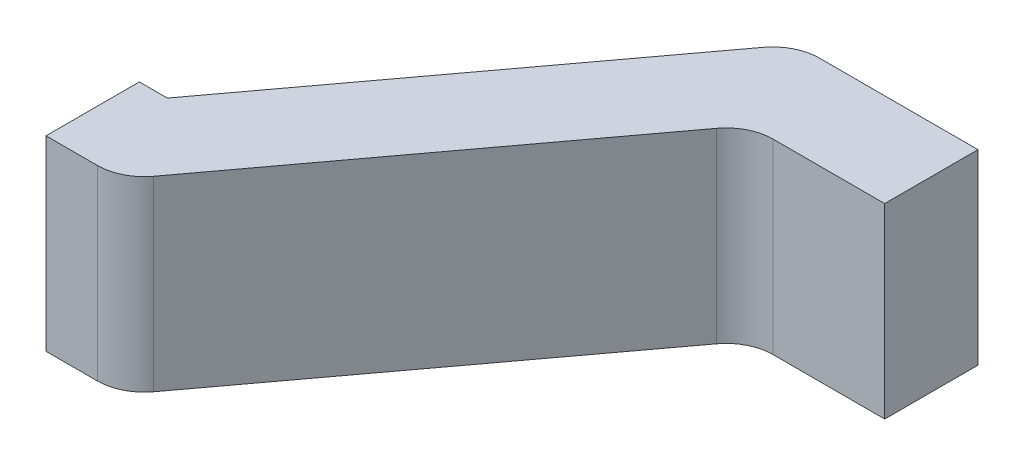
ISO-10303-21;
HEADER;
FILE_DESCRIPTION(('STEP AP214'),'2;1');
FILE_NAME('part.step','',(''),(''),'','','');
FILE_SCHEMA(('AUTOMOTIVE_DESIGN { 1 0 10303 214 1 1 1 1 }'));
ENDSEC;
DATA;
#1=APPLICATION_CONTEXT('core data for automotive mechanical design processes');
#2=APPLICATION_PROTOCOL_DEFINITION('international standard','automotive_design',2000,#1);
#3=PRODUCT_CONTEXT('',#1,'mechanical');
#4=PRODUCT('Part','Part','',(#3));
#5=PRODUCT_RELATED_PRODUCT_CATEGORY('part','',(#4));
#6=PRODUCT_DEFINITION_FORMATION('','',#4);
#7=PRODUCT_DEFINITION_CONTEXT('part definition',#1,'design');
#8=PRODUCT_DEFINITION('design','',#6,#7);
#9=PRODUCT_DEFINITION_SHAPE('','',#8);
#10=(LENGTH_UNIT() NAMED_UNIT(*) SI_UNIT(.MILLI.,.METRE.));
#11=(NAMED_UNIT(*) PLANE_ANGLE_UNIT() SI_UNIT($,.RADIAN.));
#12=(NAMED_UNIT(*) SI_UNIT($,.STERADIAN.) SOLID_ANGLE_UNIT());
#13=UNCERTAINTY_MEASURE_WITH_UNIT(LENGTH_MEASURE(1.E-05),#10,'distance_accuracy_value','');
#14=(GEOMETRIC_REPRESENTATION_CONTEXT(3) GLOBAL_UNCERTAINTY_ASSIGNED_CONTEXT((#13)) GLOBAL_UNIT_ASSIGNED_CONTEXT((#10,
#11,#12)) REPRESENTATION_CONTEXT('',''));
#15=CARTESIAN_POINT('',(0.,0.,0.));
#16=DIRECTION('',(0.,0.,1.));
#17=DIRECTION('',(1.,0.,0.));
#18=AXIS2_PLACEMENT_3D('',#15,#16,#17);
#19=CARTESIAN_POINT('',(2.6,1.7,0.205));
#20=DIRECTION('',(0.,0.,1.));
#21=DIRECTION('',(1.,0.,0.));
#22=AXIS2_PLACEMENT_3D('',#19,#20,#21);
#23=PLANE('',#22);
#24=DIRECTION('',(1.,0.,0.));
#25=VECTOR('',#24,1.);
#26=CARTESIAN_POINT('',(2.6,2.11,0.205));
#27=LINE('',#26,#25);
#28=CARTESIAN_POINT('',(2.754632601552,2.11,0.205));
#29=VERTEX_POINT('',#28);
#30=CARTESIAN_POINT('',(3.,2.11,0.205));
#31=VERTEX_POINT('',#30);
#32=EDGE_CURVE('E11',#29,#31,#27,.T.);
#33=ORIENTED_EDGE('',*,*,#32,.F.);
#34=DIRECTION('',(0.,1.,0.));
#35=VECTOR('',#34,1.);
#36=CARTESIAN_POINT('',(2.754632601552,1.7,0.205));
#37=LINE('',#36,#35);
#38=CARTESIAN_POINT('',(2.754632601552,1.7,0.205));
#39=VERTEX_POINT('',#38);
#40=EDGE_CURVE('E24',#39,#29,#37,.T.);
#41=ORIENTED_EDGE('',*,*,#40,.F.);
#42=DIRECTION('',(1.,0.,0.));
#43=VECTOR('',#42,1.);
#44=CARTESIAN_POINT('',(2.6,1.7,0.205));
#45=LINE('',#44,#43);
#46=CARTESIAN_POINT('',(3.,1.7,0.205));
#47=VERTEX_POINT('',#46);
#48=EDGE_CURVE('E172',#39,#47,#45,.T.);
#49=ORIENTED_EDGE('',*,*,#48,.T.);
#50=DIRECTION('',(0.,1.,0.));
#51=VECTOR('',#50,1.);
#52=CARTESIAN_POINT('',(3.,1.7,0.205));
#53=LINE('',#52,#51);
#54=EDGE_CURVE('E170',#47,#31,#53,.T.);
#55=ORIENTED_EDGE('',*,*,#54,.T.);
#56=EDGE_LOOP('',(#33,#41,#49,#55));
#57=FACE_BOUND('',#56,.T.);
#58=ADVANCED_FACE('F17',(#57),#23,.T.);
#59=CARTESIAN_POINT('',(2.6,2.11,0.));
#60=DIRECTION('',(0.,1.,0.));
#61=DIRECTION('',(0.,0.,1.));
#62=AXIS2_PLACEMENT_3D('',#59,#60,#61);
#63=PLANE('',#62);
#64=DIRECTION('',(1.,0.,0.));
#65=VECTOR('',#64,1.);
#66=CARTESIAN_POINT('',(2.6,2.11,0.));
#67=LINE('',#66,#65);
#68=CARTESIAN_POINT('',(2.651544200517,2.11,0.));
#69=VERTEX_POINT('',#68);
#70=CARTESIAN_POINT('',(3.,2.11,0.));
#71=VERTEX_POINT('',#70);
#72=EDGE_CURVE('E168',#69,#71,#67,.T.);
#73=ORIENTED_EDGE('',*,*,#72,.F.);
#74=CARTESIAN_POINT('',(2.651544200517,2.11,0.1025));
#75=DIRECTION('',(0.,1.,0.));
#76=DIRECTION('',(0.,0.,1.));
#77=AXIS2_PLACEMENT_3D('',#74,#75,#76);
#78=CIRCLE('',#77,0.1025);
#79=CARTESIAN_POINT('',(2.569262956102,2.11,0.0413767898629));
#80=VERTEX_POINT('',#79);
#81=EDGE_CURVE('E118',#69,#80,#78,.T.);
#82=ORIENTED_EDGE('',*,*,#81,.T.);
#83=DIRECTION('',(-0.596324001338072,0.,0.802743847954097));
#84=VECTOR('',#83,1.);
#85=CARTESIAN_POINT('',(2.6,2.11,0.));
#86=LINE('',#85,#84);
#87=CARTESIAN_POINT('',(2.011474087796,2.11,0.792246420274));
#88=VERTEX_POINT('',#87);
#89=EDGE_CURVE('E165',#80,#88,#86,.T.);
#90=ORIENTED_EDGE('',*,*,#89,.T.);
#91=DIRECTION('',(1.,0.,0.));
#92=VECTOR('',#91,1.);
#93=CARTESIAN_POINT('',(1.95,2.11,0.792246420274));
#94=LINE('',#93,#92);
#95=CARTESIAN_POINT('',(1.95,2.11,0.792246420274));
#96=VERTEX_POINT('',#95);
#97=EDGE_CURVE('E162',#96,#88,#94,.T.);
#98=ORIENTED_EDGE('',*,*,#97,.F.);
#99=DIRECTION('',(0.,0.,1.));
#100=VECTOR('',#99,1.);
#101=CARTESIAN_POINT('',(1.95,2.11,0.792246420274));
#102=LINE('',#101,#100);
#103=CARTESIAN_POINT('',(1.95,2.11,0.997246420274));
#104=VERTEX_POINT('',#103);
#105=EDGE_CURVE('E160',#96,#104,#102,.T.);
#106=ORIENTED_EDGE('',*,*,#105,.T.);
#107=DIRECTION('',(1.,0.,0.));
#108=VECTOR('',#107,1.);
#109=CARTESIAN_POINT('',(1.95,2.11,0.997246420274));
#110=LINE('',#109,#108);
#111=CARTESIAN_POINT('',(2.063018288313,2.11,0.997246420274));
#112=VERTEX_POINT('',#111);
#113=EDGE_CURVE('E158',#104,#112,#110,.T.);
#114=ORIENTED_EDGE('',*,*,#113,.T.);
#115=CARTESIAN_POINT('',(2.063018288313,2.11,0.894746420274));
#116=DIRECTION('',(0.,-1.,0.));
#117=DIRECTION('',(0.,0.,1.));
#118=AXIS2_PLACEMENT_3D('',#115,#116,#117);
#119=CIRCLE('',#118,0.1025);
#120=CARTESIAN_POINT('',(2.145299532729,2.11,0.955869630411));
#121=VERTEX_POINT('',#120);
#122=EDGE_CURVE('E155',#121,#112,#119,.T.);
#123=ORIENTED_EDGE('',*,*,#122,.F.);
#124=DIRECTION('',(-0.596324001338072,0.,0.802743847954097));
#125=VECTOR('',#124,1.);
#126=CARTESIAN_POINT('',(2.764562488831,2.11,0.122246420274));
#127=LINE('',#126,#125);
#128=CARTESIAN_POINT('',(2.672351357136,2.11,0.246376789863));
#129=VERTEX_POINT('',#128);
#130=EDGE_CURVE('E152',#129,#121,#127,.T.);
#131=ORIENTED_EDGE('',*,*,#130,.F.);
#132=CARTESIAN_POINT('',(2.754632601552,2.11,0.3075));
#133=DIRECTION('',(0.,1.,0.));
#134=DIRECTION('',(0.,0.,1.));
#135=AXIS2_PLACEMENT_3D('',#132,#133,#134);
#136=CIRCLE('',#135,0.1025);
#137=EDGE_CURVE('E149',#29,#129,#136,.T.);
#138=ORIENTED_EDGE('',*,*,#137,.F.);
#139=ORIENTED_EDGE('',*,*,#32,.T.);
#140=DIRECTION('',(0.,0.,1.));
#141=VECTOR('',#140,1.);
#142=CARTESIAN_POINT('',(3.,2.11,0.));
#143=LINE('',#142,#141);
#144=EDGE_CURVE('E146',#71,#31,#143,.T.);
#145=ORIENTED_EDGE('',*,*,#144,.F.);
#146=EDGE_LOOP('',(#73,#82,#90,#98,#106,#114,#123,#131,#138,#139,#145));
#147=FACE_BOUND('',#146,.T.);
#148=ADVANCED_FACE('F178',(#147),#63,.T.);
#149=CARTESIAN_POINT('',(2.754632601552,1.7,0.3075));
#150=DIRECTION('',(0.,1.,0.));
#151=DIRECTION('',(0.,0.,-1.));
#152=AXIS2_PLACEMENT_3D('',#149,#150,#151);
#153=CYLINDRICAL_SURFACE('',#152,0.1025);
#154=ORIENTED_EDGE('',*,*,#40,.T.);
#155=ORIENTED_EDGE('',*,*,#137,.T.);
#156=DIRECTION('',(0.,1.,0.));
#157=VECTOR('',#156,1.);
#158=CARTESIAN_POINT('',(2.672351357136,1.7,0.246376789863));
#159=LINE('',#158,#157);
#160=CARTESIAN_POINT('',(2.672351357136,1.7,0.246376789863));
#161=VERTEX_POINT('',#160);
#162=EDGE_CURVE('E143',#161,#129,#159,.T.);
#163=ORIENTED_EDGE('',*,*,#162,.F.);
#164=CARTESIAN_POINT('',(2.754632601552,1.7,0.3075));
#165=DIRECTION('',(0.,1.,0.));
#166=DIRECTION('',(0.,0.,1.));
#167=AXIS2_PLACEMENT_3D('',#164,#165,#166);
#168=CIRCLE('',#167,0.1025);
#169=EDGE_CURVE('E141',#39,#161,#168,.T.);
#170=ORIENTED_EDGE('',*,*,#169,.F.);
#171=EDGE_LOOP('',(#154,#155,#163,#170));
#172=FACE_BOUND('',#171,.T.);
#173=ADVANCED_FACE('F175',(#172),#153,.F.);
#174=CARTESIAN_POINT('',(3.,1.7,0.));
#175=DIRECTION('',(1.,0.,0.));
#176=DIRECTION('',(0.,0.,1.));
#177=AXIS2_PLACEMENT_3D('',#174,#175,#176);
#178=PLANE('',#177);
#179=DIRECTION('',(0.,0.,1.));
#180=VECTOR('',#179,1.);
#181=CARTESIAN_POINT('',(3.,1.7,0.));
#182=LINE('',#181,#180);
#183=CARTESIAN_POINT('',(3.,1.7,0.));
#184=VERTEX_POINT('',#183);
#185=EDGE_CURVE('E139',#184,#47,#182,.T.);
#186=ORIENTED_EDGE('',*,*,#185,.F.);
#187=DIRECTION('',(0.,1.,0.));
#188=VECTOR('',#187,1.);
#189=CARTESIAN_POINT('',(3.,1.7,0.));
#190=LINE('',#189,#188);
#191=EDGE_CURVE('E103',#184,#71,#190,.T.);
#192=ORIENTED_EDGE('',*,*,#191,.T.);
#193=ORIENTED_EDGE('',*,*,#144,.T.);
#194=ORIENTED_EDGE('',*,*,#54,.F.);
#195=EDGE_LOOP('',(#186,#192,#193,#194));
#196=FACE_BOUND('',#195,.T.);
#197=ADVANCED_FACE('F217',(#196),#178,.T.);
#198=CARTESIAN_POINT('',(2.6,1.7,0.));
#199=DIRECTION('',(0.,1.,0.));
#200=DIRECTION('',(0.,0.,1.));
#201=AXIS2_PLACEMENT_3D('',#198,#199,#200);
#202=PLANE('',#201);
#203=ORIENTED_EDGE('',*,*,#185,.T.);
#204=ORIENTED_EDGE('',*,*,#48,.F.);
#205=ORIENTED_EDGE('',*,*,#169,.T.);
#206=DIRECTION('',(-0.596324001338072,0.,0.802743847954097));
#207=VECTOR('',#206,1.);
#208=CARTESIAN_POINT('',(2.764562488831,1.7,0.122246420274));
#209=LINE('',#208,#207);
#210=CARTESIAN_POINT('',(2.145299532729,1.7,0.955869630411));
#211=VERTEX_POINT('',#210);
#212=EDGE_CURVE('E135',#161,#211,#209,.T.);
#213=ORIENTED_EDGE('',*,*,#212,.T.);
#214=CARTESIAN_POINT('',(2.063018288313,1.7,0.894746420274));
#215=DIRECTION('',(0.,-1.,0.));
#216=DIRECTION('',(0.,0.,1.));
#217=AXIS2_PLACEMENT_3D('',#214,#215,#216);
#218=CIRCLE('',#217,0.1025);
#219=CARTESIAN_POINT('',(2.063018288313,1.7,0.997246420274));
#220=VERTEX_POINT('',#219);
#221=EDGE_CURVE('E132',#211,#220,#218,.T.);
#222=ORIENTED_EDGE('',*,*,#221,.T.);
#223=DIRECTION('',(1.,0.,0.));
#224=VECTOR('',#223,1.);
#225=CARTESIAN_POINT('',(1.95,1.7,0.997246420274));
#226=LINE('',#225,#224);
#227=CARTESIAN_POINT('',(1.95,1.7,0.997246420274));
#228=VERTEX_POINT('',#227);
#229=EDGE_CURVE('E130',#228,#220,#226,.T.);
#230=ORIENTED_EDGE('',*,*,#229,.F.);
#231=DIRECTION('',(0.,0.,1.));
#232=VECTOR('',#231,1.);
#233=CARTESIAN_POINT('',(1.95,1.7,0.792246420274));
#234=LINE('',#233,#232);
#235=CARTESIAN_POINT('',(1.95,1.7,0.792246420274));
#236=VERTEX_POINT('',#235);
#237=EDGE_CURVE('E128',#236,#228,#234,.T.);
#238=ORIENTED_EDGE('',*,*,#237,.F.);
#239=DIRECTION('',(1.,0.,0.));
#240=VECTOR('',#239,1.);
#241=CARTESIAN_POINT('',(1.95,1.7,0.792246420274));
#242=LINE('',#241,#240);
#243=CARTESIAN_POINT('',(2.011474087796,1.7,0.792246420274));
#244=VERTEX_POINT('',#243);
#245=EDGE_CURVE('E126',#236,#244,#242,.T.);
#246=ORIENTED_EDGE('',*,*,#245,.T.);
#247=DIRECTION('',(-0.596324001338072,0.,0.802743847954097));
#248=VECTOR('',#247,1.);
#249=CARTESIAN_POINT('',(2.6,1.7,0.));
#250=LINE('',#249,#248);
#251=CARTESIAN_POINT('',(2.569262956102,1.7,0.0413767898629));
#252=VERTEX_POINT('',#251);
#253=EDGE_CURVE('E111',#252,#244,#250,.T.);
#254=ORIENTED_EDGE('',*,*,#253,.F.);
#255=CARTESIAN_POINT('',(2.651544200517,1.7,0.1025));
#256=DIRECTION('',(0.,1.,0.));
#257=DIRECTION('',(0.,0.,1.));
#258=AXIS2_PLACEMENT_3D('',#255,#256,#257);
#259=CIRCLE('',#258,0.1025);
#260=CARTESIAN_POINT('',(2.651544200517,1.7,0.));
#261=VERTEX_POINT('',#260);
#262=EDGE_CURVE('E106',#261,#252,#259,.T.);
#263=ORIENTED_EDGE('',*,*,#262,.F.);
#264=DIRECTION('',(1.,0.,0.));
#265=VECTOR('',#264,1.);
#266=CARTESIAN_POINT('',(2.6,1.7,0.));
#267=LINE('',#266,#265);
#268=EDGE_CURVE('E97',#261,#184,#267,.T.);
#269=ORIENTED_EDGE('',*,*,#268,.T.);
#270=EDGE_LOOP('',(#203,#204,#205,#213,#222,#230,#238,#246,#254,#263,#269));
#271=FACE_BOUND('',#270,.T.);
#272=ADVANCED_FACE('F109',(#271),#202,.F.);
#273=CARTESIAN_POINT('',(2.6,1.7,0.));
#274=DIRECTION('',(0.,0.,1.));
#275=DIRECTION('',(1.,0.,0.));
#276=AXIS2_PLACEMENT_3D('',#273,#274,#275);
#277=PLANE('',#276);
#278=DIRECTION('',(0.,1.,0.));
#279=VECTOR('',#278,1.);
#280=CARTESIAN_POINT('',(2.651544200517,1.7,0.));
#281=LINE('',#280,#279);
#282=EDGE_CURVE('E101',#261,#69,#281,.T.);
#283=ORIENTED_EDGE('',*,*,#282,.T.);
#284=ORIENTED_EDGE('',*,*,#72,.T.);
#285=ORIENTED_EDGE('',*,*,#191,.F.);
#286=ORIENTED_EDGE('',*,*,#268,.F.);
#287=EDGE_LOOP('',(#283,#284,#285,#286));
#288=FACE_BOUND('',#287,.T.);
#289=ADVANCED_FACE('F99',(#288),#277,.F.);
#290=CARTESIAN_POINT('',(2.651544200517,1.7,0.1025));
#291=DIRECTION('',(0.,1.,0.));
#292=DIRECTION('',(0.,0.,-1.));
#293=AXIS2_PLACEMENT_3D('',#290,#291,#292);
#294=CYLINDRICAL_SURFACE('',#293,0.1025);
#295=ORIENTED_EDGE('',*,*,#262,.T.);
#296=DIRECTION('',(0.,1.,0.));
#297=VECTOR('',#296,1.);
#298=CARTESIAN_POINT('',(2.569262956102,1.7,0.0413767898629));
#299=LINE('',#298,#297);
#300=EDGE_CURVE('E119',#252,#80,#299,.T.);
#301=ORIENTED_EDGE('',*,*,#300,.T.);
#302=ORIENTED_EDGE('',*,*,#81,.F.);
#303=ORIENTED_EDGE('',*,*,#282,.F.);
#304=EDGE_LOOP('',(#295,#301,#302,#303));
#305=FACE_BOUND('',#304,.T.);
#306=ADVANCED_FACE('F117',(#305),#294,.T.);
#307=CARTESIAN_POINT('',(2.6,1.7,0.));
#308=DIRECTION('',(0.802743847954097,0.,0.596324001338072));
#309=DIRECTION('',(-0.596324001338072,0.,0.802743847954097));
#310=AXIS2_PLACEMENT_3D('',#307,#308,#309);
#311=PLANE('',#310);
#312=DIRECTION('',(0.,1.,0.));
#313=VECTOR('',#312,1.);
#314=CARTESIAN_POINT('',(2.011474087796,1.7,0.792246420274));
#315=LINE('',#314,#313);
#316=EDGE_CURVE('E121',#244,#88,#315,.T.);
#317=ORIENTED_EDGE('',*,*,#316,.T.);
#318=ORIENTED_EDGE('',*,*,#89,.F.);
#319=ORIENTED_EDGE('',*,*,#300,.F.);
#320=ORIENTED_EDGE('',*,*,#253,.T.);
#321=EDGE_LOOP('',(#317,#318,#319,#320));
#322=FACE_BOUND('',#321,.T.);
#323=ADVANCED_FACE('F202',(#322),#311,.F.);
#324=CARTESIAN_POINT('',(1.95,1.7,0.792246420274));
#325=DIRECTION('',(0.,0.,1.));
#326=DIRECTION('',(1.,0.,0.));
#327=AXIS2_PLACEMENT_3D('',#324,#325,#326);
#328=PLANE('',#327);
#329=ORIENTED_EDGE('',*,*,#316,.F.);
#330=ORIENTED_EDGE('',*,*,#245,.F.);
#331=DIRECTION('',(0.,1.,0.));
#332=VECTOR('',#331,1.);
#333=CARTESIAN_POINT('',(1.95,1.7,0.792246420274));
#334=LINE('',#333,#332);
#335=EDGE_CURVE('E193',#236,#96,#334,.T.);
#336=ORIENTED_EDGE('',*,*,#335,.T.);
#337=ORIENTED_EDGE('',*,*,#97,.T.);
#338=EDGE_LOOP('',(#329,#330,#336,#337));
#339=FACE_BOUND('',#338,.T.);
#340=ADVANCED_FACE('F204',(#339),#328,.F.);
#341=CARTESIAN_POINT('',(1.95,1.7,0.792246420274));
#342=DIRECTION('',(1.,0.,0.));
#343=DIRECTION('',(0.,0.,1.));
#344=AXIS2_PLACEMENT_3D('',#341,#342,#343);
#345=PLANE('',#344);
#346=ORIENTED_EDGE('',*,*,#237,.T.);
#347=DIRECTION('',(0.,1.,0.));
#348=VECTOR('',#347,1.);
#349=CARTESIAN_POINT('',(1.95,1.7,0.997246420274));
#350=LINE('',#349,#348);
#351=EDGE_CURVE('E189',#228,#104,#350,.T.);
#352=ORIENTED_EDGE('',*,*,#351,.T.);
#353=ORIENTED_EDGE('',*,*,#105,.F.);
#354=ORIENTED_EDGE('',*,*,#335,.F.);
#355=EDGE_LOOP('',(#346,#352,#353,#354));
#356=FACE_BOUND('',#355,.T.);
#357=ADVANCED_FACE('F210',(#356),#345,.F.);
#358=CARTESIAN_POINT('',(2.764562488831,1.7,0.122246420274));
#359=DIRECTION('',(0.802743847954097,0.,0.596324001338072));
#360=DIRECTION('',(-0.596324001338072,0.,0.802743847954097));
#361=AXIS2_PLACEMENT_3D('',#358,#359,#360);
#362=PLANE('',#361);
#363=ORIENTED_EDGE('',*,*,#212,.F.);
#364=ORIENTED_EDGE('',*,*,#162,.T.);
#365=ORIENTED_EDGE('',*,*,#130,.T.);
#366=DIRECTION('',(0.,1.,0.));
#367=VECTOR('',#366,1.);
#368=CARTESIAN_POINT('',(2.145299532729,1.7,0.955869630411));
#369=LINE('',#368,#367);
#370=EDGE_CURVE('E184',#211,#121,#369,.T.);
#371=ORIENTED_EDGE('',*,*,#370,.F.);
#372=EDGE_LOOP('',(#363,#364,#365,#371));
#373=FACE_BOUND('',#372,.T.);
#374=ADVANCED_FACE('F183',(#373),#362,.T.);
#375=CARTESIAN_POINT('',(1.95,1.7,0.997246420274));
#376=DIRECTION('',(0.,0.,1.));
#377=DIRECTION('',(1.,0.,0.));
#378=AXIS2_PLACEMENT_3D('',#375,#376,#377);
#379=PLANE('',#378);
#380=ORIENTED_EDGE('',*,*,#113,.F.);
#381=ORIENTED_EDGE('',*,*,#351,.F.);
#382=ORIENTED_EDGE('',*,*,#229,.T.);
#383=DIRECTION('',(0.,1.,0.));
#384=VECTOR('',#383,1.);
#385=CARTESIAN_POINT('',(2.063018288313,1.7,0.997246420274));
#386=LINE('',#385,#384);
#387=EDGE_CURVE('E190',#220,#112,#386,.T.);
#388=ORIENTED_EDGE('',*,*,#387,.T.);
#389=EDGE_LOOP('',(#380,#381,#382,#388));
#390=FACE_BOUND('',#389,.T.);
#391=ADVANCED_FACE('F214',(#390),#379,.T.);
#392=CARTESIAN_POINT('',(2.063018288313,1.7,0.894746420274));
#393=DIRECTION('',(0.,1.,0.));
#394=DIRECTION('',(0.802743847954097,0.,0.596324001338072));
#395=AXIS2_PLACEMENT_3D('',#392,#393,#394);
#396=CYLINDRICAL_SURFACE('',#395,0.1025);
#397=ORIENTED_EDGE('',*,*,#370,.T.);
#398=ORIENTED_EDGE('',*,*,#122,.T.);
#399=ORIENTED_EDGE('',*,*,#387,.F.);
#400=ORIENTED_EDGE('',*,*,#221,.F.);
#401=EDGE_LOOP('',(#397,#398,#399,#400));
#402=FACE_BOUND('',#401,.T.);
#403=ADVANCED_FACE('F186',(#402),#396,.T.);
#404=CLOSED_SHELL('',(#58,#148,#173,#197,#272,#289,#306,#323,#340,#357,#374,#391,#403));
#405=MANIFOLD_SOLID_BREP('B1',#404);
#406=ADVANCED_BREP_SHAPE_REPRESENTATION('',(#18,#405),#14);
#407=SHAPE_DEFINITION_REPRESENTATION(#9,#406);
ENDSEC;
END-ISO-10303-21;
